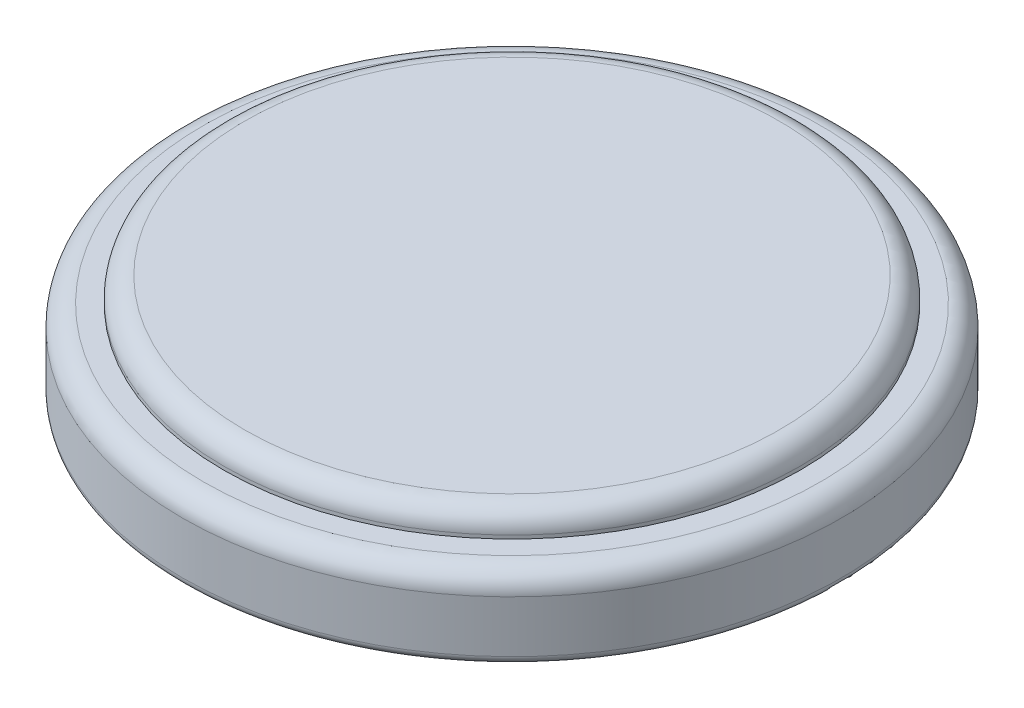
ISO-10303-21;
HEADER;
FILE_DESCRIPTION(('STEP AP214'),'2;1');
FILE_NAME('part.step','',(''),(''),'','','');
FILE_SCHEMA(('AUTOMOTIVE_DESIGN { 1 0 10303 214 1 1 1 1 }'));
ENDSEC;
DATA;
#1=APPLICATION_CONTEXT('core data for automotive mechanical design processes');
#2=APPLICATION_PROTOCOL_DEFINITION('international standard','automotive_design',2000,#1);
#3=PRODUCT_CONTEXT('',#1,'mechanical');
#4=PRODUCT('Part','Part','',(#3));
#5=PRODUCT_RELATED_PRODUCT_CATEGORY('part','',(#4));
#6=PRODUCT_DEFINITION_FORMATION('','',#4);
#7=PRODUCT_DEFINITION_CONTEXT('part definition',#1,'design');
#8=PRODUCT_DEFINITION('design','',#6,#7);
#9=PRODUCT_DEFINITION_SHAPE('','',#8);
#10=(LENGTH_UNIT() NAMED_UNIT(*) SI_UNIT(.MILLI.,.METRE.));
#11=(NAMED_UNIT(*) PLANE_ANGLE_UNIT() SI_UNIT($,.RADIAN.));
#12=(NAMED_UNIT(*) SI_UNIT($,.STERADIAN.) SOLID_ANGLE_UNIT());
#13=UNCERTAINTY_MEASURE_WITH_UNIT(LENGTH_MEASURE(1.E-05),#10,'distance_accuracy_value','');
#14=(GEOMETRIC_REPRESENTATION_CONTEXT(3) GLOBAL_UNCERTAINTY_ASSIGNED_CONTEXT((#13)) GLOBAL_UNIT_ASSIGNED_CONTEXT((#10,
#11,#12)) REPRESENTATION_CONTEXT('',''));
#15=CARTESIAN_POINT('',(0.,0.,0.));
#16=DIRECTION('',(0.,0.,1.));
#17=DIRECTION('',(1.,0.,0.));
#18=AXIS2_PLACEMENT_3D('',#15,#16,#17);
#19=CARTESIAN_POINT('',(10.,0.,0.));
#20=DIRECTION('',(0.,-1.,0.));
#21=DIRECTION('',(0.,0.,-1.));
#22=AXIS2_PLACEMENT_3D('',#19,#20,#21);
#23=PLANE('',#22);
#24=CARTESIAN_POINT('',(0.,0.,0.));
#25=DIRECTION('',(0.,-1.,0.));
#26=DIRECTION('',(0.,0.,-1.));
#27=AXIS2_PLACEMENT_3D('',#24,#25,#26);
#28=CIRCLE('',#27,9.746);
#29=CARTESIAN_POINT('',(0.,0.,-9.746));
#30=VERTEX_POINT('',#29);
#31=EDGE_CURVE('E40',#30,#30,#28,.T.);
#32=ORIENTED_EDGE('',*,*,#31,.T.);
#33=EDGE_LOOP('',(#32));
#34=FACE_BOUND('',#33,.T.);
#35=ADVANCED_FACE('F33',(#34),#23,.T.);
#36=CARTESIAN_POINT('',(8.75,3.2,0.));
#37=DIRECTION('',(0.,1.,0.));
#38=DIRECTION('',(0.,0.,1.));
#39=AXIS2_PLACEMENT_3D('',#36,#37,#38);
#40=PLANE('',#39);
#41=CARTESIAN_POINT('',(0.,3.2,0.));
#42=DIRECTION('',(0.,1.,0.));
#43=DIRECTION('',(0.,0.,1.));
#44=AXIS2_PLACEMENT_3D('',#41,#42,#43);
#45=CIRCLE('',#44,8.115);
#46=CARTESIAN_POINT('',(0.,3.2,8.115));
#47=VERTEX_POINT('',#46);
#48=EDGE_CURVE('E53',#47,#47,#45,.T.);
#49=ORIENTED_EDGE('',*,*,#48,.T.);
#50=EDGE_LOOP('',(#49));
#51=FACE_BOUND('',#50,.T.);
#52=ADVANCED_FACE('F67',(#51),#40,.T.);
#53=CARTESIAN_POINT('',(0.,0.,0.));
#54=DIRECTION('',(0.,-1.,0.));
#55=DIRECTION('',(0.,0.,-1.));
#56=AXIS2_PLACEMENT_3D('',#53,#54,#55);
#57=CYLINDRICAL_SURFACE('',#56,8.75);
#58=CARTESIAN_POINT('',(0.,2.565,0.));
#59=DIRECTION('',(0.,1.,0.));
#60=DIRECTION('',(0.,0.,1.));
#61=AXIS2_PLACEMENT_3D('',#58,#59,#60);
#62=CIRCLE('',#61,8.75);
#63=CARTESIAN_POINT('',(0.,2.565,8.75));
#64=VERTEX_POINT('',#63);
#65=EDGE_CURVE('E56',#64,#64,#62,.F.);
#66=ORIENTED_EDGE('',*,*,#65,.T.);
#67=EDGE_LOOP('',(#66));
#68=FACE_BOUND('',#67,.T.);
#69=CARTESIAN_POINT('',(0.,2.46,0.));
#70=DIRECTION('',(0.,-1.,0.));
#71=DIRECTION('',(0.,0.,-1.));
#72=AXIS2_PLACEMENT_3D('',#69,#70,#71);
#73=CIRCLE('',#72,8.75);
#74=CARTESIAN_POINT('',(0.,2.46,-8.75));
#75=VERTEX_POINT('',#74);
#76=EDGE_CURVE('E59',#75,#75,#73,.T.);
#77=ORIENTED_EDGE('',*,*,#76,.F.);
#78=EDGE_LOOP('',(#77));
#79=FACE_BOUND('',#78,.T.);
#80=ADVANCED_FACE('F65',(#68,#79),#57,.T.);
#81=CARTESIAN_POINT('',(8.75,2.46,0.));
#82=DIRECTION('',(0.,1.,0.));
#83=DIRECTION('',(0.,0.,1.));
#84=AXIS2_PLACEMENT_3D('',#81,#82,#83);
#85=PLANE('',#84);
#86=CARTESIAN_POINT('',(0.,2.46,0.));
#87=DIRECTION('',(0.,1.,0.));
#88=DIRECTION('',(0.,0.,1.));
#89=AXIS2_PLACEMENT_3D('',#86,#87,#88);
#90=CIRCLE('',#89,9.365);
#91=CARTESIAN_POINT('',(0.,2.46,9.365));
#92=VERTEX_POINT('',#91);
#93=EDGE_CURVE('E44',#92,#92,#90,.T.);
#94=ORIENTED_EDGE('',*,*,#93,.T.);
#95=EDGE_LOOP('',(#94));
#96=FACE_BOUND('',#95,.T.);
#97=ORIENTED_EDGE('',*,*,#76,.T.);
#98=EDGE_LOOP('',(#97));
#99=FACE_BOUND('',#98,.T.);
#100=ADVANCED_FACE('F63',(#96,#99),#85,.T.);
#101=CARTESIAN_POINT('',(0.,0.,0.));
#102=DIRECTION('',(0.,-1.,0.));
#103=DIRECTION('',(0.,0.,-1.));
#104=AXIS2_PLACEMENT_3D('',#101,#102,#103);
#105=CYLINDRICAL_SURFACE('',#104,10.);
#106=CARTESIAN_POINT('',(0.,0.254,0.));
#107=DIRECTION('',(0.,-1.,0.));
#108=DIRECTION('',(0.,0.,-1.));
#109=AXIS2_PLACEMENT_3D('',#106,#107,#108);
#110=CIRCLE('',#109,10.);
#111=CARTESIAN_POINT('',(0.,0.254,-10.));
#112=VERTEX_POINT('',#111);
#113=EDGE_CURVE('E10',#112,#112,#110,.F.);
#114=ORIENTED_EDGE('',*,*,#113,.T.);
#115=EDGE_LOOP('',(#114));
#116=FACE_BOUND('',#115,.T.);
#117=CARTESIAN_POINT('',(0.,1.825,0.));
#118=DIRECTION('',(0.,1.,0.));
#119=DIRECTION('',(0.,0.,1.));
#120=AXIS2_PLACEMENT_3D('',#117,#118,#119);
#121=CIRCLE('',#120,10.);
#122=CARTESIAN_POINT('',(0.,1.825,10.));
#123=VERTEX_POINT('',#122);
#124=EDGE_CURVE('E48',#123,#123,#121,.F.);
#125=ORIENTED_EDGE('',*,*,#124,.T.);
#126=EDGE_LOOP('',(#125));
#127=FACE_BOUND('',#126,.T.);
#128=ADVANCED_FACE('F74',(#116,#127),#105,.T.);
#129=CARTESIAN_POINT('',(0.,2.565,0.));
#130=DIRECTION('',(0.,1.,0.));
#131=DIRECTION('',(0.,0.,1.));
#132=AXIS2_PLACEMENT_3D('',#129,#130,#131);
#133=TOROIDAL_SURFACE('',#132,8.115,0.635);
#134=ORIENTED_EDGE('',*,*,#48,.F.);
#135=EDGE_LOOP('',(#134));
#136=FACE_BOUND('',#135,.T.);
#137=ORIENTED_EDGE('',*,*,#65,.F.);
#138=EDGE_LOOP('',(#137));
#139=FACE_BOUND('',#138,.T.);
#140=ADVANCED_FACE('F84',(#136,#139),#133,.T.);
#141=CARTESIAN_POINT('',(0.,1.825,0.));
#142=DIRECTION('',(0.,1.,0.));
#143=DIRECTION('',(0.,0.,1.));
#144=AXIS2_PLACEMENT_3D('',#141,#142,#143);
#145=TOROIDAL_SURFACE('',#144,9.365,0.635);
#146=ORIENTED_EDGE('',*,*,#93,.F.);
#147=EDGE_LOOP('',(#146));
#148=FACE_BOUND('',#147,.T.);
#149=ORIENTED_EDGE('',*,*,#124,.F.);
#150=EDGE_LOOP('',(#149));
#151=FACE_BOUND('',#150,.T.);
#152=ADVANCED_FACE('F86',(#148,#151),#145,.T.);
#153=CARTESIAN_POINT('',(0.,0.254,0.));
#154=DIRECTION('',(0.,-1.,0.));
#155=DIRECTION('',(0.,0.,-1.));
#156=AXIS2_PLACEMENT_3D('',#153,#154,#155);
#157=TOROIDAL_SURFACE('',#156,9.746,0.254);
#158=ORIENTED_EDGE('',*,*,#113,.F.);
#159=EDGE_LOOP('',(#158));
#160=FACE_BOUND('',#159,.T.);
#161=ORIENTED_EDGE('',*,*,#31,.F.);
#162=EDGE_LOOP('',(#161));
#163=FACE_BOUND('',#162,.T.);
#164=ADVANCED_FACE('F35',(#160,#163),#157,.T.);
#165=CLOSED_SHELL('',(#35,#52,#80,#100,#128,#140,#152,#164));
#166=MANIFOLD_SOLID_BREP('B2',#165);
#167=ADVANCED_BREP_SHAPE_REPRESENTATION('',(#18,#166),#14);
#168=SHAPE_DEFINITION_REPRESENTATION(#9,#167);
ENDSEC;
END-ISO-10303-21;
